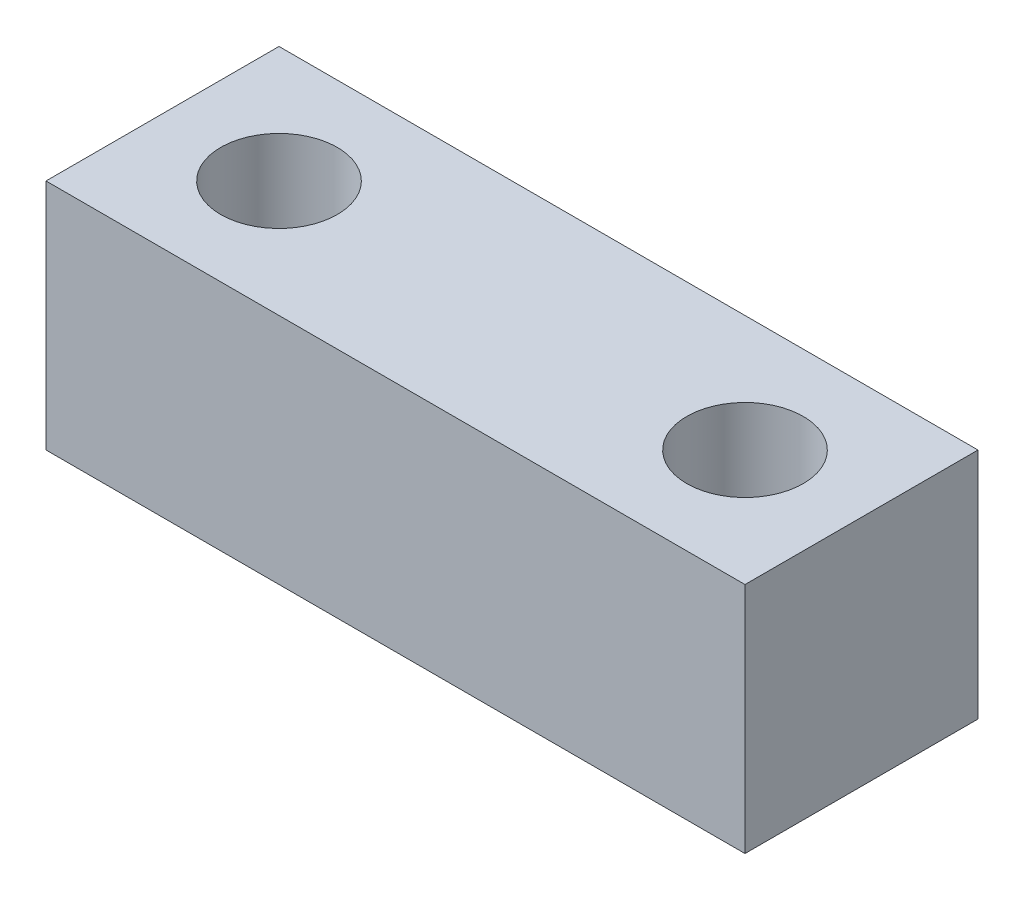
ISO-10303-21;
HEADER;
FILE_DESCRIPTION(('STEP AP214'),'2;1');
FILE_NAME('part.step','',(''),(''),'','','');
FILE_SCHEMA(('AUTOMOTIVE_DESIGN { 1 0 10303 214 1 1 1 1 }'));
ENDSEC;
DATA;
#1=APPLICATION_CONTEXT('core data for automotive mechanical design processes');
#2=APPLICATION_PROTOCOL_DEFINITION('international standard','automotive_design',2000,#1);
#3=PRODUCT_CONTEXT('',#1,'mechanical');
#4=PRODUCT('Part','Part','',(#3));
#5=PRODUCT_RELATED_PRODUCT_CATEGORY('part','',(#4));
#6=PRODUCT_DEFINITION_FORMATION('','',#4);
#7=PRODUCT_DEFINITION_CONTEXT('part definition',#1,'design');
#8=PRODUCT_DEFINITION('design','',#6,#7);
#9=PRODUCT_DEFINITION_SHAPE('','',#8);
#10=(LENGTH_UNIT() NAMED_UNIT(*) SI_UNIT(.MILLI.,.METRE.));
#11=(NAMED_UNIT(*) PLANE_ANGLE_UNIT() SI_UNIT($,.RADIAN.));
#12=(NAMED_UNIT(*) SI_UNIT($,.STERADIAN.) SOLID_ANGLE_UNIT());
#13=UNCERTAINTY_MEASURE_WITH_UNIT(LENGTH_MEASURE(1.E-05),#10,'distance_accuracy_value','');
#14=(GEOMETRIC_REPRESENTATION_CONTEXT(3) GLOBAL_UNCERTAINTY_ASSIGNED_CONTEXT((#13)) GLOBAL_UNIT_ASSIGNED_CONTEXT((#10,
#11,#12)) REPRESENTATION_CONTEXT('',''));
#15=CARTESIAN_POINT('',(0.,0.,0.));
#16=DIRECTION('',(0.,0.,1.));
#17=DIRECTION('',(1.,0.,0.));
#18=AXIS2_PLACEMENT_3D('',#15,#16,#17);
#19=CARTESIAN_POINT('',(0.,25.4,0.));
#20=DIRECTION('',(0.,1.,0.));
#21=DIRECTION('',(0.,0.,1.));
#22=AXIS2_PLACEMENT_3D('',#19,#20,#21);
#23=PLANE('',#22);
#24=CARTESIAN_POINT('',(-63.5,25.4,-12.7));
#25=DIRECTION('',(0.,1.,0.));
#26=DIRECTION('',(0.,0.,1.));
#27=AXIS2_PLACEMENT_3D('',#24,#25,#26);
#28=CIRCLE('',#27,6.35);
#29=CARTESIAN_POINT('',(-63.5,25.4,-6.34999999999999));
#30=VERTEX_POINT('',#29);
#31=EDGE_CURVE('E100',#30,#30,#28,.T.);
#32=ORIENTED_EDGE('',*,*,#31,.F.);
#33=EDGE_LOOP('',(#32));
#34=FACE_BOUND('',#33,.T.);
#35=DIRECTION('',(0.,0.,-1.));
#36=VECTOR('',#35,1.);
#37=CARTESIAN_POINT('',(0.,25.4,0.));
#38=LINE('',#37,#36);
#39=CARTESIAN_POINT('',(0.,25.4,0.));
#40=VERTEX_POINT('',#39);
#41=CARTESIAN_POINT('',(0.,25.4,-25.4));
#42=VERTEX_POINT('',#41);
#43=EDGE_CURVE('E85',#40,#42,#38,.T.);
#44=ORIENTED_EDGE('',*,*,#43,.T.);
#45=DIRECTION('',(-1.,0.,0.));
#46=VECTOR('',#45,1.);
#47=CARTESIAN_POINT('',(0.,25.4,-25.4));
#48=LINE('',#47,#46);
#49=CARTESIAN_POINT('',(-76.2,25.4,-25.4));
#50=VERTEX_POINT('',#49);
#51=EDGE_CURVE('E80',#42,#50,#48,.T.);
#52=ORIENTED_EDGE('',*,*,#51,.T.);
#53=DIRECTION('',(0.,0.,1.));
#54=VECTOR('',#53,1.);
#55=CARTESIAN_POINT('',(-76.2,25.4,0.));
#56=LINE('',#55,#54);
#57=CARTESIAN_POINT('',(-76.2,25.4,0.));
#58=VERTEX_POINT('',#57);
#59=EDGE_CURVE('E83',#50,#58,#56,.T.);
#60=ORIENTED_EDGE('',*,*,#59,.T.);
#61=DIRECTION('',(1.,0.,0.));
#62=VECTOR('',#61,1.);
#63=CARTESIAN_POINT('',(0.,25.4,0.));
#64=LINE('',#63,#62);
#65=EDGE_CURVE('E50',#58,#40,#64,.T.);
#66=ORIENTED_EDGE('',*,*,#65,.T.);
#67=EDGE_LOOP('',(#44,#52,#60,#66));
#68=FACE_BOUND('',#67,.T.);
#69=CARTESIAN_POINT('',(-12.7,25.4,-12.7));
#70=DIRECTION('',(0.,1.,0.));
#71=DIRECTION('',(0.,0.,1.));
#72=AXIS2_PLACEMENT_3D('',#69,#70,#71);
#73=CIRCLE('',#72,6.35);
#74=CARTESIAN_POINT('',(-12.7,25.4,-6.35));
#75=VERTEX_POINT('',#74);
#76=EDGE_CURVE('E115',#75,#75,#73,.T.);
#77=ORIENTED_EDGE('',*,*,#76,.F.);
#78=EDGE_LOOP('',(#77));
#79=FACE_BOUND('',#78,.T.);
#80=ADVANCED_FACE('F33',(#34,#68,#79),#23,.T.);
#81=CARTESIAN_POINT('',(0.,0.,0.));
#82=DIRECTION('',(0.,1.,0.));
#83=DIRECTION('',(0.,0.,1.));
#84=AXIS2_PLACEMENT_3D('',#81,#82,#83);
#85=PLANE('',#84);
#86=DIRECTION('',(0.,0.,-1.));
#87=VECTOR('',#86,1.);
#88=CARTESIAN_POINT('',(0.,0.,0.));
#89=LINE('',#88,#87);
#90=CARTESIAN_POINT('',(0.,0.,0.));
#91=VERTEX_POINT('',#90);
#92=CARTESIAN_POINT('',(0.,0.,-25.4));
#93=VERTEX_POINT('',#92);
#94=EDGE_CURVE('E97',#91,#93,#89,.T.);
#95=ORIENTED_EDGE('',*,*,#94,.F.);
#96=DIRECTION('',(1.,0.,0.));
#97=VECTOR('',#96,1.);
#98=CARTESIAN_POINT('',(0.,0.,0.));
#99=LINE('',#98,#97);
#100=CARTESIAN_POINT('',(-76.2,0.,0.));
#101=VERTEX_POINT('',#100);
#102=EDGE_CURVE('E73',#101,#91,#99,.T.);
#103=ORIENTED_EDGE('',*,*,#102,.F.);
#104=DIRECTION('',(0.,0.,1.));
#105=VECTOR('',#104,1.);
#106=CARTESIAN_POINT('',(-76.2,0.,0.));
#107=LINE('',#106,#105);
#108=CARTESIAN_POINT('',(-76.2,0.,-25.4));
#109=VERTEX_POINT('',#108);
#110=EDGE_CURVE('E67',#109,#101,#107,.T.);
#111=ORIENTED_EDGE('',*,*,#110,.F.);
#112=DIRECTION('',(-1.,0.,0.));
#113=VECTOR('',#112,1.);
#114=CARTESIAN_POINT('',(0.,0.,-25.4));
#115=LINE('',#114,#113);
#116=EDGE_CURVE('E89',#93,#109,#115,.T.);
#117=ORIENTED_EDGE('',*,*,#116,.F.);
#118=EDGE_LOOP('',(#95,#103,#111,#117));
#119=FACE_BOUND('',#118,.T.);
#120=CARTESIAN_POINT('',(-63.5,0.,-12.7));
#121=DIRECTION('',(0.,1.,0.));
#122=DIRECTION('',(0.,0.,1.));
#123=AXIS2_PLACEMENT_3D('',#120,#121,#122);
#124=CIRCLE('',#123,6.35);
#125=CARTESIAN_POINT('',(-63.5,0.,-6.34999999999999));
#126=VERTEX_POINT('',#125);
#127=EDGE_CURVE('E112',#126,#126,#124,.T.);
#128=ORIENTED_EDGE('',*,*,#127,.T.);
#129=EDGE_LOOP('',(#128));
#130=FACE_BOUND('',#129,.T.);
#131=CARTESIAN_POINT('',(-12.7,0.,-12.7));
#132=DIRECTION('',(0.,1.,0.));
#133=DIRECTION('',(0.,0.,1.));
#134=AXIS2_PLACEMENT_3D('',#131,#132,#133);
#135=CIRCLE('',#134,6.35);
#136=CARTESIAN_POINT('',(-12.7,0.,-6.35));
#137=VERTEX_POINT('',#136);
#138=EDGE_CURVE('E118',#137,#137,#135,.T.);
#139=ORIENTED_EDGE('',*,*,#138,.T.);
#140=EDGE_LOOP('',(#139));
#141=FACE_BOUND('',#140,.T.);
#142=ADVANCED_FACE('F108',(#119,#130,#141),#85,.F.);
#143=CARTESIAN_POINT('',(0.,25.4,0.));
#144=DIRECTION('',(-1.,0.,0.));
#145=DIRECTION('',(0.,0.,1.));
#146=AXIS2_PLACEMENT_3D('',#143,#144,#145);
#147=PLANE('',#146);
#148=ORIENTED_EDGE('',*,*,#94,.T.);
#149=DIRECTION('',(0.,-1.,0.));
#150=VECTOR('',#149,1.);
#151=CARTESIAN_POINT('',(0.,25.4,-25.4));
#152=LINE('',#151,#150);
#153=EDGE_CURVE('E11',#42,#93,#152,.T.);
#154=ORIENTED_EDGE('',*,*,#153,.F.);
#155=ORIENTED_EDGE('',*,*,#43,.F.);
#156=DIRECTION('',(0.,-1.,0.));
#157=VECTOR('',#156,1.);
#158=CARTESIAN_POINT('',(0.,25.4,0.));
#159=LINE('',#158,#157);
#160=EDGE_CURVE('E93',#40,#91,#159,.T.);
#161=ORIENTED_EDGE('',*,*,#160,.T.);
#162=EDGE_LOOP('',(#148,#154,#155,#161));
#163=FACE_BOUND('',#162,.T.);
#164=ADVANCED_FACE('F35',(#163),#147,.F.);
#165=CARTESIAN_POINT('',(0.,25.4,-25.4));
#166=DIRECTION('',(0.,0.,1.));
#167=DIRECTION('',(1.,0.,0.));
#168=AXIS2_PLACEMENT_3D('',#165,#166,#167);
#169=PLANE('',#168);
#170=ORIENTED_EDGE('',*,*,#116,.T.);
#171=DIRECTION('',(0.,-1.,0.));
#172=VECTOR('',#171,1.);
#173=CARTESIAN_POINT('',(-76.2,25.4,-25.4));
#174=LINE('',#173,#172);
#175=EDGE_CURVE('E42',#50,#109,#174,.T.);
#176=ORIENTED_EDGE('',*,*,#175,.F.);
#177=ORIENTED_EDGE('',*,*,#51,.F.);
#178=ORIENTED_EDGE('',*,*,#153,.T.);
#179=EDGE_LOOP('',(#170,#176,#177,#178));
#180=FACE_BOUND('',#179,.T.);
#181=ADVANCED_FACE('F88',(#180),#169,.F.);
#182=CARTESIAN_POINT('',(-76.2,25.4,0.));
#183=DIRECTION('',(1.,0.,0.));
#184=DIRECTION('',(0.,0.,-1.));
#185=AXIS2_PLACEMENT_3D('',#182,#183,#184);
#186=PLANE('',#185);
#187=ORIENTED_EDGE('',*,*,#110,.T.);
#188=DIRECTION('',(0.,-1.,0.));
#189=VECTOR('',#188,1.);
#190=CARTESIAN_POINT('',(-76.2,25.4,0.));
#191=LINE('',#190,#189);
#192=EDGE_CURVE('E90',#58,#101,#191,.T.);
#193=ORIENTED_EDGE('',*,*,#192,.F.);
#194=ORIENTED_EDGE('',*,*,#59,.F.);
#195=ORIENTED_EDGE('',*,*,#175,.T.);
#196=EDGE_LOOP('',(#187,#193,#194,#195));
#197=FACE_BOUND('',#196,.T.);
#198=ADVANCED_FACE('F91',(#197),#186,.F.);
#199=CARTESIAN_POINT('',(0.,25.4,0.));
#200=DIRECTION('',(0.,0.,-1.));
#201=DIRECTION('',(-1.,0.,0.));
#202=AXIS2_PLACEMENT_3D('',#199,#200,#201);
#203=PLANE('',#202);
#204=ORIENTED_EDGE('',*,*,#102,.T.);
#205=ORIENTED_EDGE('',*,*,#160,.F.);
#206=ORIENTED_EDGE('',*,*,#65,.F.);
#207=ORIENTED_EDGE('',*,*,#192,.T.);
#208=EDGE_LOOP('',(#204,#205,#206,#207));
#209=FACE_BOUND('',#208,.T.);
#210=ADVANCED_FACE('F105',(#209),#203,.F.);
#211=CARTESIAN_POINT('',(-63.5,25.4,-12.7));
#212=DIRECTION('',(0.,-1.,0.));
#213=DIRECTION('',(0.,0.,-1.));
#214=AXIS2_PLACEMENT_3D('',#211,#212,#213);
#215=CYLINDRICAL_SURFACE('',#214,6.35);
#216=ORIENTED_EDGE('',*,*,#31,.T.);
#217=EDGE_LOOP('',(#216));
#218=FACE_BOUND('',#217,.T.);
#219=ORIENTED_EDGE('',*,*,#127,.F.);
#220=EDGE_LOOP('',(#219));
#221=FACE_BOUND('',#220,.T.);
#222=ADVANCED_FACE('F135',(#218,#221),#215,.F.);
#223=CARTESIAN_POINT('',(-12.7,25.4,-12.7));
#224=DIRECTION('',(0.,-1.,0.));
#225=DIRECTION('',(0.,0.,-1.));
#226=AXIS2_PLACEMENT_3D('',#223,#224,#225);
#227=CYLINDRICAL_SURFACE('',#226,6.35);
#228=ORIENTED_EDGE('',*,*,#76,.T.);
#229=EDGE_LOOP('',(#228));
#230=FACE_BOUND('',#229,.T.);
#231=ORIENTED_EDGE('',*,*,#138,.F.);
#232=EDGE_LOOP('',(#231));
#233=FACE_BOUND('',#232,.T.);
#234=ADVANCED_FACE('F124',(#230,#233),#227,.F.);
#235=CLOSED_SHELL('',(#80,#142,#164,#181,#198,#210,#222,#234));
#236=MANIFOLD_SOLID_BREP('B2',#235);
#237=ADVANCED_BREP_SHAPE_REPRESENTATION('',(#18,#236),#14);
#238=SHAPE_DEFINITION_REPRESENTATION(#9,#237);
ENDSEC;
END-ISO-10303-21;
